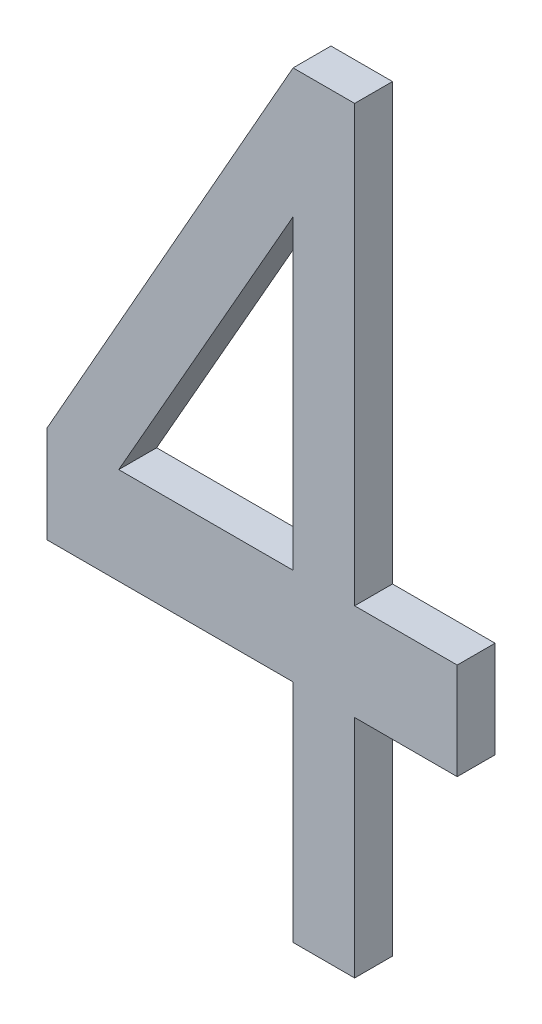
ISO-10303-21;
HEADER;
FILE_DESCRIPTION(('STEP AP214'),'2;1');
FILE_NAME('part.step','',(''),(''),'','','');
FILE_SCHEMA(('AUTOMOTIVE_DESIGN { 1 0 10303 214 1 1 1 1 }'));
ENDSEC;
DATA;
#1=APPLICATION_CONTEXT('core data for automotive mechanical design processes');
#2=APPLICATION_PROTOCOL_DEFINITION('international standard','automotive_design',2000,#1);
#3=PRODUCT_CONTEXT('',#1,'mechanical');
#4=PRODUCT('Part','Part','',(#3));
#5=PRODUCT_RELATED_PRODUCT_CATEGORY('part','',(#4));
#6=PRODUCT_DEFINITION_FORMATION('','',#4);
#7=PRODUCT_DEFINITION_CONTEXT('part definition',#1,'design');
#8=PRODUCT_DEFINITION('design','',#6,#7);
#9=PRODUCT_DEFINITION_SHAPE('','',#8);
#10=(LENGTH_UNIT() NAMED_UNIT(*) SI_UNIT(.MILLI.,.METRE.));
#11=(NAMED_UNIT(*) PLANE_ANGLE_UNIT() SI_UNIT($,.RADIAN.));
#12=(NAMED_UNIT(*) SI_UNIT($,.STERADIAN.) SOLID_ANGLE_UNIT());
#13=UNCERTAINTY_MEASURE_WITH_UNIT(LENGTH_MEASURE(1.E-05),#10,'distance_accuracy_value','');
#14=(GEOMETRIC_REPRESENTATION_CONTEXT(3) GLOBAL_UNCERTAINTY_ASSIGNED_CONTEXT((#13)) GLOBAL_UNIT_ASSIGNED_CONTEXT((#10,
#11,#12)) REPRESENTATION_CONTEXT('',''));
#15=CARTESIAN_POINT('',(0.,0.,0.));
#16=DIRECTION('',(0.,0.,1.));
#17=DIRECTION('',(1.,0.,0.));
#18=AXIS2_PLACEMENT_3D('',#15,#16,#17);
#19=CARTESIAN_POINT('',(91.6064978060074,28.8864156879183,5.9));
#20=DIRECTION('',(0.,0.,1.));
#21=DIRECTION('',(1.,0.,0.));
#22=AXIS2_PLACEMENT_3D('',#19,#20,#21);
#23=PLANE('',#22);
#24=DIRECTION('',(0.,1.,0.));
#25=VECTOR('',#24,1.);
#26=CARTESIAN_POINT('',(92.2564977285074,29.9502455271484,5.9));
#27=LINE('',#26,#25);
#28=CARTESIAN_POINT('',(92.2564977285097,29.1417348660183,5.9));
#29=VERTEX_POINT('',#28);
#30=CARTESIAN_POINT('',(92.2564977285143,29.9502455271432,5.9));
#31=VERTEX_POINT('',#30);
#32=EDGE_CURVE('E190',#29,#31,#27,.T.);
#33=ORIENTED_EDGE('',*,*,#32,.T.);
#34=DIRECTION('',(-0.494850558055973,-0.868978092469363,0.));
#35=VECTOR('',#34,1.);
#36=CARTESIAN_POINT('',(91.7960811135074,29.1417348660183,5.9));
#37=LINE('',#36,#35);
#38=CARTESIAN_POINT('',(91.7960811135074,29.1417348660183,5.9));
#39=VERTEX_POINT('',#38);
#40=EDGE_CURVE('E183',#31,#39,#37,.T.);
#41=ORIENTED_EDGE('',*,*,#40,.T.);
#42=DIRECTION('',(1.,0.,0.));
#43=VECTOR('',#42,1.);
#44=CARTESIAN_POINT('',(92.2564977285074,29.1417348660183,5.9));
#45=LINE('',#44,#43);
#46=EDGE_CURVE('E179',#39,#29,#45,.T.);
#47=ORIENTED_EDGE('',*,*,#46,.T.);
#48=EDGE_LOOP('',(#33,#41,#47));
#49=FACE_BOUND('',#48,.T.);
#50=DIRECTION('',(0.492402398324293,0.870367668358886,0.));
#51=VECTOR('',#50,1.);
#52=CARTESIAN_POINT('',(92.2564977285074,30.2906710184783,5.9));
#53=LINE('',#52,#51);
#54=CARTESIAN_POINT('',(91.6064978060046,29.1417348660199,5.9));
#55=VERTEX_POINT('',#54);
#56=CARTESIAN_POINT('',(92.2564977285074,30.2906710184783,5.9));
#57=VERTEX_POINT('',#56);
#58=EDGE_CURVE('E177',#55,#57,#53,.T.);
#59=ORIENTED_EDGE('',*,*,#58,.T.);
#60=DIRECTION('',(1.,0.,0.));
#61=VECTOR('',#60,1.);
#62=CARTESIAN_POINT('',(92.4189977285074,30.2906710184783,5.9));
#63=LINE('',#62,#61);
#64=CARTESIAN_POINT('',(92.4189977285074,30.2906710184783,5.9));
#65=VERTEX_POINT('',#64);
#66=EDGE_CURVE('E171',#57,#65,#63,.T.);
#67=ORIENTED_EDGE('',*,*,#66,.T.);
#68=DIRECTION('',(0.,1.,0.));
#69=VECTOR('',#68,1.);
#70=CARTESIAN_POINT('',(92.4189977285074,29.1417348660183,5.9));
#71=LINE('',#70,#69);
#72=CARTESIAN_POINT('',(92.4189977285074,29.1417348660183,5.9));
#73=VERTEX_POINT('',#72);
#74=EDGE_CURVE('E166',#65,#73,#71,.F.);
#75=ORIENTED_EDGE('',*,*,#74,.T.);
#76=DIRECTION('',(1.,0.,0.));
#77=VECTOR('',#76,1.);
#78=CARTESIAN_POINT('',(92.6898311135074,29.1417348660183,5.9));
#79=LINE('',#78,#77);
#80=CARTESIAN_POINT('',(92.6898311135074,29.1417348660183,5.9));
#81=VERTEX_POINT('',#80);
#82=EDGE_CURVE('E161',#73,#81,#79,.T.);
#83=ORIENTED_EDGE('',*,*,#82,.T.);
#84=DIRECTION('',(0.,1.,0.));
#85=VECTOR('',#84,1.);
#86=CARTESIAN_POINT('',(92.6898311135074,28.8864156879183,5.9));
#87=LINE('',#86,#85);
#88=CARTESIAN_POINT('',(92.6898311135074,28.8864156879183,5.9));
#89=VERTEX_POINT('',#88);
#90=EDGE_CURVE('E156',#81,#89,#87,.F.);
#91=ORIENTED_EDGE('',*,*,#90,.T.);
#92=DIRECTION('',(1.,0.,0.));
#93=VECTOR('',#92,1.);
#94=CARTESIAN_POINT('',(92.4189977285074,28.8864156879183,5.9));
#95=LINE('',#94,#93);
#96=CARTESIAN_POINT('',(92.4189977285074,28.8864156879183,5.9));
#97=VERTEX_POINT('',#96);
#98=EDGE_CURVE('E151',#89,#97,#95,.F.);
#99=ORIENTED_EDGE('',*,*,#98,.T.);
#100=DIRECTION('',(0.,1.,0.));
#101=VECTOR('',#100,1.);
#102=CARTESIAN_POINT('',(92.4189977285074,28.2906710184784,5.9));
#103=LINE('',#102,#101);
#104=CARTESIAN_POINT('',(92.4189977285074,28.2906710184784,5.9));
#105=VERTEX_POINT('',#104);
#106=EDGE_CURVE('E146',#97,#105,#103,.F.);
#107=ORIENTED_EDGE('',*,*,#106,.T.);
#108=DIRECTION('',(1.,0.,0.));
#109=VECTOR('',#108,1.);
#110=CARTESIAN_POINT('',(92.2564977285074,28.2906710184784,5.9));
#111=LINE('',#110,#109);
#112=CARTESIAN_POINT('',(92.2564977285074,28.2906710184784,5.9));
#113=VERTEX_POINT('',#112);
#114=EDGE_CURVE('E142',#105,#113,#111,.F.);
#115=ORIENTED_EDGE('',*,*,#114,.T.);
#116=DIRECTION('',(0.,1.,0.));
#117=VECTOR('',#116,1.);
#118=CARTESIAN_POINT('',(92.2564977285074,28.8864156879183,5.9));
#119=LINE('',#118,#117);
#120=CARTESIAN_POINT('',(92.2564977285074,28.8864156879183,5.9));
#121=VERTEX_POINT('',#120);
#122=EDGE_CURVE('E129',#113,#121,#119,.T.);
#123=ORIENTED_EDGE('',*,*,#122,.T.);
#124=DIRECTION('',(1.,0.,0.));
#125=VECTOR('',#124,1.);
#126=CARTESIAN_POINT('',(91.6064978060074,28.8864156879183,5.9));
#127=LINE('',#126,#125);
#128=CARTESIAN_POINT('',(91.6064978060074,28.8864156879183,5.9));
#129=VERTEX_POINT('',#128);
#130=EDGE_CURVE('E115',#121,#129,#127,.F.);
#131=ORIENTED_EDGE('',*,*,#130,.T.);
#132=DIRECTION('',(0.,1.,0.));
#133=VECTOR('',#132,1.);
#134=CARTESIAN_POINT('',(91.6064978060074,29.1417348660183,5.9));
#135=LINE('',#134,#133);
#136=EDGE_CURVE('E20',#129,#55,#135,.T.);
#137=ORIENTED_EDGE('',*,*,#136,.T.);
#138=EDGE_LOOP('',(#59,#67,#75,#83,#91,#99,#107,#115,#123,#131,#137));
#139=FACE_BOUND('',#138,.T.);
#140=ADVANCED_FACE('F17',(#49,#139),#23,.F.);
#141=CARTESIAN_POINT('',(91.6064978060074,29.1417348660183,6.));
#142=DIRECTION('',(1.,0.,0.));
#143=DIRECTION('',(0.,0.,-1.));
#144=AXIS2_PLACEMENT_3D('',#141,#142,#143);
#145=PLANE('',#144);
#146=DIRECTION('',(0.,0.,1.));
#147=VECTOR('',#146,1.);
#148=CARTESIAN_POINT('',(91.6064978060074,28.8864156879183,6.));
#149=LINE('',#148,#147);
#150=CARTESIAN_POINT('',(91.6064978060074,28.8864156879183,6.));
#151=VERTEX_POINT('',#150);
#152=EDGE_CURVE('E121',#129,#151,#149,.T.);
#153=ORIENTED_EDGE('',*,*,#152,.T.);
#154=DIRECTION('',(0.,1.,0.));
#155=VECTOR('',#154,1.);
#156=CARTESIAN_POINT('',(91.6064978060074,28.8864156879183,6.));
#157=LINE('',#156,#155);
#158=CARTESIAN_POINT('',(91.6064978060046,29.1417348660199,6.));
#159=VERTEX_POINT('',#158);
#160=EDGE_CURVE('E193',#159,#151,#157,.F.);
#161=ORIENTED_EDGE('',*,*,#160,.F.);
#162=DIRECTION('',(0.,0.,1.));
#163=VECTOR('',#162,1.);
#164=CARTESIAN_POINT('',(91.6064978059961,29.1417348660247,6.));
#165=LINE('',#164,#163);
#166=EDGE_CURVE('E124',#159,#55,#165,.F.);
#167=ORIENTED_EDGE('',*,*,#166,.T.);
#168=ORIENTED_EDGE('',*,*,#136,.F.);
#169=EDGE_LOOP('',(#153,#161,#167,#168));
#170=FACE_BOUND('',#169,.T.);
#171=ADVANCED_FACE('F120',(#170),#145,.F.);
#172=CARTESIAN_POINT('',(91.6064978060074,28.8864156879183,6.));
#173=DIRECTION('',(0.,1.,0.));
#174=DIRECTION('',(0.,0.,1.));
#175=AXIS2_PLACEMENT_3D('',#172,#173,#174);
#176=PLANE('',#175);
#177=DIRECTION('',(0.,0.,-1.));
#178=VECTOR('',#177,1.);
#179=CARTESIAN_POINT('',(92.2564977285074,28.8864156879183,6.));
#180=LINE('',#179,#178);
#181=CARTESIAN_POINT('',(92.2564977285074,28.8864156879183,6.));
#182=VERTEX_POINT('',#181);
#183=EDGE_CURVE('E131',#121,#182,#180,.F.);
#184=ORIENTED_EDGE('',*,*,#183,.T.);
#185=DIRECTION('',(1.,0.,0.));
#186=VECTOR('',#185,1.);
#187=CARTESIAN_POINT('',(91.6064978060074,28.8864156879183,6.));
#188=LINE('',#187,#186);
#189=EDGE_CURVE('E135',#151,#182,#188,.T.);
#190=ORIENTED_EDGE('',*,*,#189,.F.);
#191=ORIENTED_EDGE('',*,*,#152,.F.);
#192=ORIENTED_EDGE('',*,*,#130,.F.);
#193=EDGE_LOOP('',(#184,#190,#191,#192));
#194=FACE_BOUND('',#193,.T.);
#195=ADVANCED_FACE('F133',(#194),#176,.F.);
#196=CARTESIAN_POINT('',(92.2564977285074,28.8864156879183,6.));
#197=DIRECTION('',(1.,0.,0.));
#198=DIRECTION('',(0.,0.,-1.));
#199=AXIS2_PLACEMENT_3D('',#196,#197,#198);
#200=PLANE('',#199);
#201=DIRECTION('',(0.,0.,1.));
#202=VECTOR('',#201,1.);
#203=CARTESIAN_POINT('',(92.2564977285074,28.2906710184784,6.));
#204=LINE('',#203,#202);
#205=CARTESIAN_POINT('',(92.2564977285074,28.2906710184784,6.));
#206=VERTEX_POINT('',#205);
#207=EDGE_CURVE('E140',#113,#206,#204,.T.);
#208=ORIENTED_EDGE('',*,*,#207,.T.);
#209=DIRECTION('',(0.,1.,0.));
#210=VECTOR('',#209,1.);
#211=CARTESIAN_POINT('',(92.2564977285074,28.8864156879183,6.));
#212=LINE('',#211,#210);
#213=EDGE_CURVE('E196',#182,#206,#212,.F.);
#214=ORIENTED_EDGE('',*,*,#213,.F.);
#215=ORIENTED_EDGE('',*,*,#183,.F.);
#216=ORIENTED_EDGE('',*,*,#122,.F.);
#217=EDGE_LOOP('',(#208,#214,#215,#216));
#218=FACE_BOUND('',#217,.T.);
#219=ADVANCED_FACE('F282',(#218),#200,.F.);
#220=CARTESIAN_POINT('',(92.2564977285074,28.2906710184784,6.));
#221=DIRECTION('',(0.,1.,0.));
#222=DIRECTION('',(0.,0.,1.));
#223=AXIS2_PLACEMENT_3D('',#220,#221,#222);
#224=PLANE('',#223);
#225=DIRECTION('',(0.,0.,1.));
#226=VECTOR('',#225,1.);
#227=CARTESIAN_POINT('',(92.4189977285074,28.2906710184784,6.));
#228=LINE('',#227,#226);
#229=CARTESIAN_POINT('',(92.4189977285074,28.2906710184784,6.));
#230=VERTEX_POINT('',#229);
#231=EDGE_CURVE('E144',#105,#230,#228,.T.);
#232=ORIENTED_EDGE('',*,*,#231,.T.);
#233=DIRECTION('',(1.,0.,0.));
#234=VECTOR('',#233,1.);
#235=CARTESIAN_POINT('',(91.6064978060074,28.2906710184784,6.));
#236=LINE('',#235,#234);
#237=EDGE_CURVE('E199',#206,#230,#236,.T.);
#238=ORIENTED_EDGE('',*,*,#237,.F.);
#239=ORIENTED_EDGE('',*,*,#207,.F.);
#240=ORIENTED_EDGE('',*,*,#114,.F.);
#241=EDGE_LOOP('',(#232,#238,#239,#240));
#242=FACE_BOUND('',#241,.T.);
#243=ADVANCED_FACE('F278',(#242),#224,.F.);
#244=CARTESIAN_POINT('',(92.4189977285074,28.2906710184784,6.));
#245=DIRECTION('',(-1.,0.,0.));
#246=DIRECTION('',(0.,0.,1.));
#247=AXIS2_PLACEMENT_3D('',#244,#245,#246);
#248=PLANE('',#247);
#249=DIRECTION('',(0.,0.,1.));
#250=VECTOR('',#249,1.);
#251=CARTESIAN_POINT('',(92.4189977285074,28.8864156879183,6.));
#252=LINE('',#251,#250);
#253=CARTESIAN_POINT('',(92.4189977285074,28.8864156879183,6.));
#254=VERTEX_POINT('',#253);
#255=EDGE_CURVE('E149',#97,#254,#252,.T.);
#256=ORIENTED_EDGE('',*,*,#255,.T.);
#257=DIRECTION('',(0.,1.,0.));
#258=VECTOR('',#257,1.);
#259=CARTESIAN_POINT('',(92.4189977285074,28.8864156879183,6.));
#260=LINE('',#259,#258);
#261=EDGE_CURVE('E202',#230,#254,#260,.T.);
#262=ORIENTED_EDGE('',*,*,#261,.F.);
#263=ORIENTED_EDGE('',*,*,#231,.F.);
#264=ORIENTED_EDGE('',*,*,#106,.F.);
#265=EDGE_LOOP('',(#256,#262,#263,#264));
#266=FACE_BOUND('',#265,.T.);
#267=ADVANCED_FACE('F274',(#266),#248,.F.);
#268=CARTESIAN_POINT('',(92.4189977285074,28.8864156879183,6.));
#269=DIRECTION('',(0.,1.,0.));
#270=DIRECTION('',(0.,0.,1.));
#271=AXIS2_PLACEMENT_3D('',#268,#269,#270);
#272=PLANE('',#271);
#273=DIRECTION('',(0.,0.,1.));
#274=VECTOR('',#273,1.);
#275=CARTESIAN_POINT('',(92.6898311135074,28.8864156879183,6.));
#276=LINE('',#275,#274);
#277=CARTESIAN_POINT('',(92.6898311135074,28.8864156879183,6.));
#278=VERTEX_POINT('',#277);
#279=EDGE_CURVE('E154',#89,#278,#276,.T.);
#280=ORIENTED_EDGE('',*,*,#279,.T.);
#281=DIRECTION('',(1.,0.,0.));
#282=VECTOR('',#281,1.);
#283=CARTESIAN_POINT('',(91.6064978060074,28.8864156879183,6.));
#284=LINE('',#283,#282);
#285=EDGE_CURVE('E205',#254,#278,#284,.T.);
#286=ORIENTED_EDGE('',*,*,#285,.F.);
#287=ORIENTED_EDGE('',*,*,#255,.F.);
#288=ORIENTED_EDGE('',*,*,#98,.F.);
#289=EDGE_LOOP('',(#280,#286,#287,#288));
#290=FACE_BOUND('',#289,.T.);
#291=ADVANCED_FACE('F270',(#290),#272,.F.);
#292=CARTESIAN_POINT('',(92.6898311135074,28.8864156879183,6.));
#293=DIRECTION('',(-1.,0.,0.));
#294=DIRECTION('',(0.,0.,1.));
#295=AXIS2_PLACEMENT_3D('',#292,#293,#294);
#296=PLANE('',#295);
#297=DIRECTION('',(0.,0.,-1.));
#298=VECTOR('',#297,1.);
#299=CARTESIAN_POINT('',(92.6898311135074,29.1417348660183,6.));
#300=LINE('',#299,#298);
#301=CARTESIAN_POINT('',(92.6898311135074,29.1417348660183,6.));
#302=VERTEX_POINT('',#301);
#303=EDGE_CURVE('E159',#81,#302,#300,.F.);
#304=ORIENTED_EDGE('',*,*,#303,.T.);
#305=DIRECTION('',(0.,1.,0.));
#306=VECTOR('',#305,1.);
#307=CARTESIAN_POINT('',(92.6898311135074,28.8864156879183,6.));
#308=LINE('',#307,#306);
#309=EDGE_CURVE('E208',#278,#302,#308,.T.);
#310=ORIENTED_EDGE('',*,*,#309,.F.);
#311=ORIENTED_EDGE('',*,*,#279,.F.);
#312=ORIENTED_EDGE('',*,*,#90,.F.);
#313=EDGE_LOOP('',(#304,#310,#311,#312));
#314=FACE_BOUND('',#313,.T.);
#315=ADVANCED_FACE('F266',(#314),#296,.F.);
#316=CARTESIAN_POINT('',(92.6898311135074,29.1417348660183,6.));
#317=DIRECTION('',(0.,-1.,0.));
#318=DIRECTION('',(0.,0.,-1.));
#319=AXIS2_PLACEMENT_3D('',#316,#317,#318);
#320=PLANE('',#319);
#321=DIRECTION('',(0.,0.,1.));
#322=VECTOR('',#321,1.);
#323=CARTESIAN_POINT('',(92.4189977285074,29.1417348660183,6.));
#324=LINE('',#323,#322);
#325=CARTESIAN_POINT('',(92.4189977285074,29.1417348660183,6.));
#326=VERTEX_POINT('',#325);
#327=EDGE_CURVE('E164',#73,#326,#324,.T.);
#328=ORIENTED_EDGE('',*,*,#327,.T.);
#329=DIRECTION('',(1.,0.,0.));
#330=VECTOR('',#329,1.);
#331=CARTESIAN_POINT('',(91.6064978060074,29.1417348660183,6.));
#332=LINE('',#331,#330);
#333=EDGE_CURVE('E211',#302,#326,#332,.F.);
#334=ORIENTED_EDGE('',*,*,#333,.F.);
#335=ORIENTED_EDGE('',*,*,#303,.F.);
#336=ORIENTED_EDGE('',*,*,#82,.F.);
#337=EDGE_LOOP('',(#328,#334,#335,#336));
#338=FACE_BOUND('',#337,.T.);
#339=ADVANCED_FACE('F262',(#338),#320,.F.);
#340=CARTESIAN_POINT('',(92.4189977285074,29.1417348660183,6.));
#341=DIRECTION('',(-1.,0.,0.));
#342=DIRECTION('',(0.,0.,1.));
#343=AXIS2_PLACEMENT_3D('',#340,#341,#342);
#344=PLANE('',#343);
#345=DIRECTION('',(0.,0.,-1.));
#346=VECTOR('',#345,1.);
#347=CARTESIAN_POINT('',(92.4189977285074,30.2906710184783,6.));
#348=LINE('',#347,#346);
#349=CARTESIAN_POINT('',(92.4189977285074,30.2906710184783,6.));
#350=VERTEX_POINT('',#349);
#351=EDGE_CURVE('E169',#65,#350,#348,.F.);
#352=ORIENTED_EDGE('',*,*,#351,.T.);
#353=DIRECTION('',(0.,1.,0.));
#354=VECTOR('',#353,1.);
#355=CARTESIAN_POINT('',(92.4189977285074,28.8864156879183,6.));
#356=LINE('',#355,#354);
#357=EDGE_CURVE('E214',#326,#350,#356,.T.);
#358=ORIENTED_EDGE('',*,*,#357,.F.);
#359=ORIENTED_EDGE('',*,*,#327,.F.);
#360=ORIENTED_EDGE('',*,*,#74,.F.);
#361=EDGE_LOOP('',(#352,#358,#359,#360));
#362=FACE_BOUND('',#361,.T.);
#363=ADVANCED_FACE('F258',(#362),#344,.F.);
#364=CARTESIAN_POINT('',(92.4189977285074,30.2906710184783,6.));
#365=DIRECTION('',(0.,-1.,0.));
#366=DIRECTION('',(0.,0.,-1.));
#367=AXIS2_PLACEMENT_3D('',#364,#365,#366);
#368=PLANE('',#367);
#369=DIRECTION('',(0.,0.,1.));
#370=VECTOR('',#369,1.);
#371=CARTESIAN_POINT('',(92.2564977285074,30.2906710184783,6.));
#372=LINE('',#371,#370);
#373=CARTESIAN_POINT('',(92.2564977285074,30.2906710184783,6.));
#374=VERTEX_POINT('',#373);
#375=EDGE_CURVE('E174',#57,#374,#372,.T.);
#376=ORIENTED_EDGE('',*,*,#375,.T.);
#377=DIRECTION('',(1.,0.,0.));
#378=VECTOR('',#377,1.);
#379=CARTESIAN_POINT('',(91.6064978060074,30.2906710184783,6.));
#380=LINE('',#379,#378);
#381=EDGE_CURVE('E217',#350,#374,#380,.F.);
#382=ORIENTED_EDGE('',*,*,#381,.F.);
#383=ORIENTED_EDGE('',*,*,#351,.F.);
#384=ORIENTED_EDGE('',*,*,#66,.F.);
#385=EDGE_LOOP('',(#376,#382,#383,#384));
#386=FACE_BOUND('',#385,.T.);
#387=ADVANCED_FACE('F254',(#386),#368,.F.);
#388=CARTESIAN_POINT('',(92.2564977285074,30.2906710184783,6.));
#389=DIRECTION('',(0.870367668358886,-0.492402398324293,0.));
#390=DIRECTION('',(0.492402398324293,0.870367668358886,0.));
#391=AXIS2_PLACEMENT_3D('',#388,#389,#390);
#392=PLANE('',#391);
#393=ORIENTED_EDGE('',*,*,#166,.F.);
#394=DIRECTION('',(-0.492402398315719,-0.870367668363737,0.));
#395=VECTOR('',#394,1.);
#396=CARTESIAN_POINT('',(92.2564977285074,30.2906710184783,6.));
#397=LINE('',#396,#395);
#398=EDGE_CURVE('E220',#374,#159,#397,.T.);
#399=ORIENTED_EDGE('',*,*,#398,.F.);
#400=ORIENTED_EDGE('',*,*,#375,.F.);
#401=ORIENTED_EDGE('',*,*,#58,.F.);
#402=EDGE_LOOP('',(#393,#399,#400,#401));
#403=FACE_BOUND('',#402,.T.);
#404=ADVANCED_FACE('F251',(#403),#392,.F.);
#405=CARTESIAN_POINT('',(92.2564977285074,29.1417348660183,6.));
#406=DIRECTION('',(0.,-1.,0.));
#407=DIRECTION('',(0.,0.,-1.));
#408=AXIS2_PLACEMENT_3D('',#405,#406,#407);
#409=PLANE('',#408);
#410=DIRECTION('',(0.,0.,1.));
#411=VECTOR('',#410,1.);
#412=CARTESIAN_POINT('',(91.7960811135074,29.1417348660183,6.));
#413=LINE('',#412,#411);
#414=CARTESIAN_POINT('',(91.7960811135074,29.1417348660183,6.));
#415=VERTEX_POINT('',#414);
#416=EDGE_CURVE('E181',#39,#415,#413,.T.);
#417=ORIENTED_EDGE('',*,*,#416,.T.);
#418=DIRECTION('',(1.,0.,0.));
#419=VECTOR('',#418,1.);
#420=CARTESIAN_POINT('',(91.6064978060074,29.1417348660183,6.));
#421=LINE('',#420,#419);
#422=CARTESIAN_POINT('',(92.2564977285097,29.1417348660183,6.));
#423=VERTEX_POINT('',#422);
#424=EDGE_CURVE('E223',#423,#415,#421,.F.);
#425=ORIENTED_EDGE('',*,*,#424,.F.);
#426=DIRECTION('',(0.,0.,-1.));
#427=VECTOR('',#426,1.);
#428=CARTESIAN_POINT('',(92.2564977285074,29.1417348660183,6.));
#429=LINE('',#428,#427);
#430=EDGE_CURVE('E187',#423,#29,#429,.T.);
#431=ORIENTED_EDGE('',*,*,#430,.T.);
#432=ORIENTED_EDGE('',*,*,#46,.F.);
#433=EDGE_LOOP('',(#417,#425,#431,#432));
#434=FACE_BOUND('',#433,.T.);
#435=ADVANCED_FACE('F233',(#434),#409,.F.);
#436=CARTESIAN_POINT('',(91.7960811135074,29.1417348660183,6.));
#437=DIRECTION('',(-0.868978092469363,0.494850558055973,0.));
#438=DIRECTION('',(-0.494850558055973,-0.868978092469363,0.));
#439=AXIS2_PLACEMENT_3D('',#436,#437,#438);
#440=PLANE('',#439);
#441=DIRECTION('',(0.,0.,-1.));
#442=VECTOR('',#441,1.);
#443=CARTESIAN_POINT('',(92.2564977285074,29.9502455271432,6.));
#444=LINE('',#443,#442);
#445=CARTESIAN_POINT('',(92.2564977285143,29.9502455271432,6.));
#446=VERTEX_POINT('',#445);
#447=EDGE_CURVE('E35',#31,#446,#444,.F.);
#448=ORIENTED_EDGE('',*,*,#447,.T.);
#449=DIRECTION('',(0.494850558055928,0.868978092469388,0.));
#450=VECTOR('',#449,1.);
#451=CARTESIAN_POINT('',(91.7960811135074,29.1417348660183,6.));
#452=LINE('',#451,#450);
#453=EDGE_CURVE('E26',#415,#446,#452,.T.);
#454=ORIENTED_EDGE('',*,*,#453,.F.);
#455=ORIENTED_EDGE('',*,*,#416,.F.);
#456=ORIENTED_EDGE('',*,*,#40,.F.);
#457=EDGE_LOOP('',(#448,#454,#455,#456));
#458=FACE_BOUND('',#457,.T.);
#459=ADVANCED_FACE('F231',(#458),#440,.F.);
#460=CARTESIAN_POINT('',(92.2564977285074,29.9502455271484,6.));
#461=DIRECTION('',(1.,0.,0.));
#462=DIRECTION('',(0.,0.,-1.));
#463=AXIS2_PLACEMENT_3D('',#460,#461,#462);
#464=PLANE('',#463);
#465=ORIENTED_EDGE('',*,*,#430,.F.);
#466=DIRECTION('',(0.,1.,0.));
#467=VECTOR('',#466,1.);
#468=CARTESIAN_POINT('',(92.2564977285165,28.8864156879183,6.));
#469=LINE('',#468,#467);
#470=EDGE_CURVE('E11',#446,#423,#469,.F.);
#471=ORIENTED_EDGE('',*,*,#470,.F.);
#472=ORIENTED_EDGE('',*,*,#447,.F.);
#473=ORIENTED_EDGE('',*,*,#32,.F.);
#474=EDGE_LOOP('',(#465,#471,#472,#473));
#475=FACE_BOUND('',#474,.T.);
#476=ADVANCED_FACE('F238',(#475),#464,.F.);
#477=CARTESIAN_POINT('',(91.6064978060074,28.8864156879183,6.));
#478=DIRECTION('',(0.,0.,1.));
#479=DIRECTION('',(1.,0.,0.));
#480=AXIS2_PLACEMENT_3D('',#477,#478,#479);
#481=PLANE('',#480);
#482=ORIENTED_EDGE('',*,*,#453,.T.);
#483=ORIENTED_EDGE('',*,*,#470,.T.);
#484=ORIENTED_EDGE('',*,*,#424,.T.);
#485=EDGE_LOOP('',(#482,#483,#484));
#486=FACE_BOUND('',#485,.T.);
#487=ORIENTED_EDGE('',*,*,#381,.T.);
#488=ORIENTED_EDGE('',*,*,#398,.T.);
#489=ORIENTED_EDGE('',*,*,#160,.T.);
#490=ORIENTED_EDGE('',*,*,#189,.T.);
#491=ORIENTED_EDGE('',*,*,#213,.T.);
#492=ORIENTED_EDGE('',*,*,#237,.T.);
#493=ORIENTED_EDGE('',*,*,#261,.T.);
#494=ORIENTED_EDGE('',*,*,#285,.T.);
#495=ORIENTED_EDGE('',*,*,#309,.T.);
#496=ORIENTED_EDGE('',*,*,#333,.T.);
#497=ORIENTED_EDGE('',*,*,#357,.T.);
#498=EDGE_LOOP('',(#487,#488,#489,#490,#491,#492,#493,#494,#495,#496,#497));
#499=FACE_BOUND('',#498,.T.);
#500=ADVANCED_FACE('F228',(#486,#499),#481,.T.);
#501=CLOSED_SHELL('',(#140,#171,#195,#219,#243,#267,#291,#315,#339,#363,#387,#404,#435,#459,
#476,#500));
#502=MANIFOLD_SOLID_BREP('B1',#501);
#503=ADVANCED_BREP_SHAPE_REPRESENTATION('',(#18,#502),#14);
#504=SHAPE_DEFINITION_REPRESENTATION(#9,#503);
ENDSEC;
END-ISO-10303-21;
